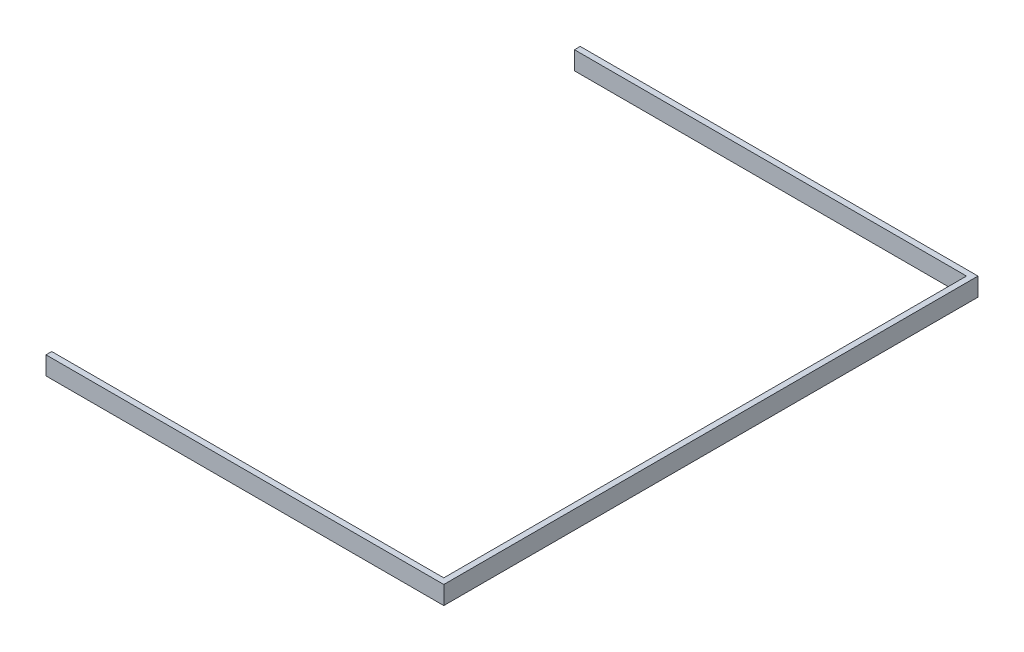
ISO-10303-21;
HEADER;
FILE_DESCRIPTION(('STEP AP214'),'2;1');
FILE_NAME('part.step','',(''),(''),'','','');
FILE_SCHEMA(('AUTOMOTIVE_DESIGN { 1 0 10303 214 1 1 1 1 }'));
ENDSEC;
DATA;
#1=APPLICATION_CONTEXT('core data for automotive mechanical design processes');
#2=APPLICATION_PROTOCOL_DEFINITION('international standard','automotive_design',2000,#1);
#3=PRODUCT_CONTEXT('',#1,'mechanical');
#4=PRODUCT('Part','Part','',(#3));
#5=PRODUCT_RELATED_PRODUCT_CATEGORY('part','',(#4));
#6=PRODUCT_DEFINITION_FORMATION('','',#4);
#7=PRODUCT_DEFINITION_CONTEXT('part definition',#1,'design');
#8=PRODUCT_DEFINITION('design','',#6,#7);
#9=PRODUCT_DEFINITION_SHAPE('','',#8);
#10=(LENGTH_UNIT() NAMED_UNIT(*) SI_UNIT(.MILLI.,.METRE.));
#11=(NAMED_UNIT(*) PLANE_ANGLE_UNIT() SI_UNIT($,.RADIAN.));
#12=(NAMED_UNIT(*) SI_UNIT($,.STERADIAN.) SOLID_ANGLE_UNIT());
#13=UNCERTAINTY_MEASURE_WITH_UNIT(LENGTH_MEASURE(1.E-05),#10,'distance_accuracy_value','');
#14=(GEOMETRIC_REPRESENTATION_CONTEXT(3) GLOBAL_UNCERTAINTY_ASSIGNED_CONTEXT((#13)) GLOBAL_UNIT_ASSIGNED_CONTEXT((#10,
#11,#12)) REPRESENTATION_CONTEXT('',''));
#15=CARTESIAN_POINT('',(0.,0.,0.));
#16=DIRECTION('',(0.,0.,1.));
#17=DIRECTION('',(1.,0.,0.));
#18=AXIS2_PLACEMENT_3D('',#15,#16,#17);
#19=CARTESIAN_POINT('',(3044.,-0.01,2044.01));
#20=DIRECTION('',(1.,0.,0.));
#21=DIRECTION('',(0.,0.,-1.));
#22=AXIS2_PLACEMENT_3D('',#19,#20,#21);
#23=PLANE('',#22);
#24=DIRECTION('',(0.,0.,-1.));
#25=VECTOR('',#24,1.);
#26=CARTESIAN_POINT('',(3044.,70.,1022.));
#27=LINE('',#26,#25);
#28=CARTESIAN_POINT('',(3044.,70.,2044.));
#29=VERTEX_POINT('',#28);
#30=CARTESIAN_POINT('',(3044.,70.,0.));
#31=VERTEX_POINT('',#30);
#32=EDGE_CURVE('E136',#29,#31,#27,.T.);
#33=ORIENTED_EDGE('',*,*,#32,.F.);
#34=DIRECTION('',(0.,1.,0.));
#35=VECTOR('',#34,1.);
#36=CARTESIAN_POINT('',(3044.,35.,2044.));
#37=LINE('',#36,#35);
#38=CARTESIAN_POINT('',(3044.,0.,2044.));
#39=VERTEX_POINT('',#38);
#40=EDGE_CURVE('E125',#39,#29,#37,.T.);
#41=ORIENTED_EDGE('',*,*,#40,.F.);
#42=DIRECTION('',(0.,0.,1.));
#43=VECTOR('',#42,1.);
#44=CARTESIAN_POINT('',(3044.,0.,1022.));
#45=LINE('',#44,#43);
#46=CARTESIAN_POINT('',(3044.,0.,0.));
#47=VERTEX_POINT('',#46);
#48=EDGE_CURVE('E124',#47,#39,#45,.T.);
#49=ORIENTED_EDGE('',*,*,#48,.F.);
#50=DIRECTION('',(0.,-1.,0.));
#51=VECTOR('',#50,1.);
#52=CARTESIAN_POINT('',(3044.,35.,0.));
#53=LINE('',#52,#51);
#54=EDGE_CURVE('E21',#31,#47,#53,.T.);
#55=ORIENTED_EDGE('',*,*,#54,.F.);
#56=EDGE_LOOP('',(#33,#41,#49,#55));
#57=FACE_BOUND('',#56,.T.);
#58=ADVANCED_FACE('F17',(#57),#23,.T.);
#59=CARTESIAN_POINT('',(3044.01,-0.01,0.));
#60=DIRECTION('',(0.,0.,-1.));
#61=DIRECTION('',(-1.,0.,0.));
#62=AXIS2_PLACEMENT_3D('',#59,#60,#61);
#63=PLANE('',#62);
#64=DIRECTION('',(-1.,0.,0.));
#65=VECTOR('',#64,1.);
#66=CARTESIAN_POINT('',(2283.,70.,-1.11459371463299E-13));
#67=LINE('',#66,#65);
#68=CARTESIAN_POINT('',(1522.,70.,0.));
#69=VERTEX_POINT('',#68);
#70=EDGE_CURVE('E119',#31,#69,#67,.T.);
#71=ORIENTED_EDGE('',*,*,#70,.F.);
#72=ORIENTED_EDGE('',*,*,#54,.T.);
#73=DIRECTION('',(1.,0.,0.));
#74=VECTOR('',#73,1.);
#75=CARTESIAN_POINT('',(2283.,0.,-1.11459371463299E-13));
#76=LINE('',#75,#74);
#77=CARTESIAN_POINT('',(1522.,0.,0.));
#78=VERTEX_POINT('',#77);
#79=EDGE_CURVE('E117',#78,#47,#76,.T.);
#80=ORIENTED_EDGE('',*,*,#79,.F.);
#81=DIRECTION('',(0.,-1.,0.));
#82=VECTOR('',#81,1.);
#83=CARTESIAN_POINT('',(1522.,35.,0.));
#84=LINE('',#83,#82);
#85=EDGE_CURVE('E108',#69,#78,#84,.T.);
#86=ORIENTED_EDGE('',*,*,#85,.F.);
#87=EDGE_LOOP('',(#71,#72,#80,#86));
#88=FACE_BOUND('',#87,.T.);
#89=ADVANCED_FACE('F115',(#88),#63,.T.);
#90=CARTESIAN_POINT('',(1522.,-0.01,-0.00999999999996337));
#91=DIRECTION('',(-1.,0.,0.));
#92=DIRECTION('',(0.,0.,1.));
#93=AXIS2_PLACEMENT_3D('',#90,#91,#92);
#94=PLANE('',#93);
#95=DIRECTION('',(0.,0.,1.));
#96=VECTOR('',#95,1.);
#97=CARTESIAN_POINT('',(1522.,70.,1022.));
#98=LINE('',#97,#96);
#99=CARTESIAN_POINT('',(1522.,70.,22.));
#100=VERTEX_POINT('',#99);
#101=EDGE_CURVE('E139',#69,#100,#98,.T.);
#102=ORIENTED_EDGE('',*,*,#101,.F.);
#103=ORIENTED_EDGE('',*,*,#85,.T.);
#104=DIRECTION('',(0.,0.,-1.));
#105=VECTOR('',#104,1.);
#106=CARTESIAN_POINT('',(1522.,0.,1022.));
#107=LINE('',#106,#105);
#108=CARTESIAN_POINT('',(1522.,0.,22.0000000000001));
#109=VERTEX_POINT('',#108);
#110=EDGE_CURVE('E99',#109,#78,#107,.T.);
#111=ORIENTED_EDGE('',*,*,#110,.F.);
#112=DIRECTION('',(0.,-1.,0.));
#113=VECTOR('',#112,1.);
#114=CARTESIAN_POINT('',(1522.,35.,22.));
#115=LINE('',#114,#113);
#116=EDGE_CURVE('E80',#100,#109,#115,.T.);
#117=ORIENTED_EDGE('',*,*,#116,.F.);
#118=EDGE_LOOP('',(#102,#103,#111,#117));
#119=FACE_BOUND('',#118,.T.);
#120=ADVANCED_FACE('F179',(#119),#94,.T.);
#121=CARTESIAN_POINT('',(1521.99,-0.01,22.));
#122=DIRECTION('',(0.,0.,1.));
#123=DIRECTION('',(1.,0.,0.));
#124=AXIS2_PLACEMENT_3D('',#121,#122,#123);
#125=PLANE('',#124);
#126=DIRECTION('',(1.,0.,0.));
#127=VECTOR('',#126,1.);
#128=CARTESIAN_POINT('',(2283.,70.,22.0000000000001));
#129=LINE('',#128,#127);
#130=CARTESIAN_POINT('',(3022.,70.,22.));
#131=VERTEX_POINT('',#130);
#132=EDGE_CURVE('E142',#100,#131,#129,.T.);
#133=ORIENTED_EDGE('',*,*,#132,.F.);
#134=ORIENTED_EDGE('',*,*,#116,.T.);
#135=DIRECTION('',(-1.,0.,0.));
#136=VECTOR('',#135,1.);
#137=CARTESIAN_POINT('',(2283.,0.,22.0000000000001));
#138=LINE('',#137,#136);
#139=CARTESIAN_POINT('',(3022.,0.,22.));
#140=VERTEX_POINT('',#139);
#141=EDGE_CURVE('E95',#140,#109,#138,.T.);
#142=ORIENTED_EDGE('',*,*,#141,.F.);
#143=DIRECTION('',(0.,-1.,0.));
#144=VECTOR('',#143,1.);
#145=CARTESIAN_POINT('',(3022.,35.,21.9999999999999));
#146=LINE('',#145,#144);
#147=EDGE_CURVE('E85',#131,#140,#146,.T.);
#148=ORIENTED_EDGE('',*,*,#147,.F.);
#149=EDGE_LOOP('',(#133,#134,#142,#148));
#150=FACE_BOUND('',#149,.T.);
#151=ADVANCED_FACE('F96',(#150),#125,.T.);
#152=CARTESIAN_POINT('',(3022.,-0.01,21.9899999999998));
#153=DIRECTION('',(-1.,0.,0.));
#154=DIRECTION('',(0.,0.,1.));
#155=AXIS2_PLACEMENT_3D('',#152,#153,#154);
#156=PLANE('',#155);
#157=DIRECTION('',(0.,0.,1.));
#158=VECTOR('',#157,1.);
#159=CARTESIAN_POINT('',(3022.,70.,1022.));
#160=LINE('',#159,#158);
#161=CARTESIAN_POINT('',(3022.,70.,2022.));
#162=VERTEX_POINT('',#161);
#163=EDGE_CURVE('E91',#131,#162,#160,.T.);
#164=ORIENTED_EDGE('',*,*,#163,.F.);
#165=ORIENTED_EDGE('',*,*,#147,.T.);
#166=DIRECTION('',(0.,0.,-1.));
#167=VECTOR('',#166,1.);
#168=CARTESIAN_POINT('',(3022.,0.,1022.));
#169=LINE('',#168,#167);
#170=CARTESIAN_POINT('',(3022.,0.,2022.));
#171=VERTEX_POINT('',#170);
#172=EDGE_CURVE('E89',#171,#140,#169,.T.);
#173=ORIENTED_EDGE('',*,*,#172,.F.);
#174=DIRECTION('',(0.,-1.,0.));
#175=VECTOR('',#174,1.);
#176=CARTESIAN_POINT('',(3022.,35.,2022.));
#177=LINE('',#176,#175);
#178=EDGE_CURVE('E147',#162,#171,#177,.T.);
#179=ORIENTED_EDGE('',*,*,#178,.F.);
#180=EDGE_LOOP('',(#164,#165,#173,#179));
#181=FACE_BOUND('',#180,.T.);
#182=ADVANCED_FACE('F86',(#181),#156,.T.);
#183=CARTESIAN_POINT('',(3044.01,0.,2044.01));
#184=DIRECTION('',(0.,-1.,0.));
#185=DIRECTION('',(-1.,0.,0.));
#186=AXIS2_PLACEMENT_3D('',#183,#184,#185);
#187=PLANE('',#186);
#188=DIRECTION('',(1.,0.,0.));
#189=VECTOR('',#188,1.);
#190=CARTESIAN_POINT('',(2283.,0.,2044.));
#191=LINE('',#190,#189);
#192=CARTESIAN_POINT('',(1522.,0.,2044.));
#193=VERTEX_POINT('',#192);
#194=EDGE_CURVE('E127',#193,#39,#191,.T.);
#195=ORIENTED_EDGE('',*,*,#194,.F.);
#196=DIRECTION('',(0.,0.,1.));
#197=VECTOR('',#196,1.);
#198=CARTESIAN_POINT('',(1522.,0.,2033.));
#199=LINE('',#198,#197);
#200=CARTESIAN_POINT('',(1522.,0.,2022.));
#201=VERTEX_POINT('',#200);
#202=EDGE_CURVE('E149',#201,#193,#199,.T.);
#203=ORIENTED_EDGE('',*,*,#202,.F.);
#204=DIRECTION('',(-1.,0.,0.));
#205=VECTOR('',#204,1.);
#206=CARTESIAN_POINT('',(2272.,0.,2022.));
#207=LINE('',#206,#205);
#208=EDGE_CURVE('E103',#171,#201,#207,.T.);
#209=ORIENTED_EDGE('',*,*,#208,.F.);
#210=ORIENTED_EDGE('',*,*,#172,.T.);
#211=ORIENTED_EDGE('',*,*,#141,.T.);
#212=ORIENTED_EDGE('',*,*,#110,.T.);
#213=ORIENTED_EDGE('',*,*,#79,.T.);
#214=ORIENTED_EDGE('',*,*,#48,.T.);
#215=EDGE_LOOP('',(#195,#203,#209,#210,#211,#212,#213,#214));
#216=FACE_BOUND('',#215,.T.);
#217=ADVANCED_FACE('F101',(#216),#187,.T.);
#218=CARTESIAN_POINT('',(1521.99,-0.01,2044.));
#219=DIRECTION('',(0.,0.,1.));
#220=DIRECTION('',(1.,0.,0.));
#221=AXIS2_PLACEMENT_3D('',#218,#219,#220);
#222=PLANE('',#221);
#223=DIRECTION('',(1.,0.,0.));
#224=VECTOR('',#223,1.);
#225=CARTESIAN_POINT('',(2283.,70.,2044.));
#226=LINE('',#225,#224);
#227=CARTESIAN_POINT('',(1522.,70.,2044.));
#228=VERTEX_POINT('',#227);
#229=EDGE_CURVE('E133',#228,#29,#226,.T.);
#230=ORIENTED_EDGE('',*,*,#229,.F.);
#231=DIRECTION('',(0.,1.,0.));
#232=VECTOR('',#231,1.);
#233=CARTESIAN_POINT('',(1522.,35.,2044.));
#234=LINE('',#233,#232);
#235=EDGE_CURVE('E152',#193,#228,#234,.T.);
#236=ORIENTED_EDGE('',*,*,#235,.F.);
#237=ORIENTED_EDGE('',*,*,#194,.T.);
#238=ORIENTED_EDGE('',*,*,#40,.T.);
#239=EDGE_LOOP('',(#230,#236,#237,#238));
#240=FACE_BOUND('',#239,.T.);
#241=ADVANCED_FACE('F160',(#240),#222,.T.);
#242=CARTESIAN_POINT('',(3044.01,70.,2044.01));
#243=DIRECTION('',(0.,1.,0.));
#244=DIRECTION('',(0.,0.,-1.));
#245=AXIS2_PLACEMENT_3D('',#242,#243,#244);
#246=PLANE('',#245);
#247=ORIENTED_EDGE('',*,*,#132,.T.);
#248=ORIENTED_EDGE('',*,*,#163,.T.);
#249=DIRECTION('',(1.,0.,0.));
#250=VECTOR('',#249,1.);
#251=CARTESIAN_POINT('',(2272.,70.,2022.));
#252=LINE('',#251,#250);
#253=CARTESIAN_POINT('',(1522.,70.,2022.));
#254=VERTEX_POINT('',#253);
#255=EDGE_CURVE('E36',#254,#162,#252,.T.);
#256=ORIENTED_EDGE('',*,*,#255,.F.);
#257=DIRECTION('',(0.,0.,-1.));
#258=VECTOR('',#257,1.);
#259=CARTESIAN_POINT('',(1522.,70.,2033.));
#260=LINE('',#259,#258);
#261=EDGE_CURVE('E27',#228,#254,#260,.T.);
#262=ORIENTED_EDGE('',*,*,#261,.F.);
#263=ORIENTED_EDGE('',*,*,#229,.T.);
#264=ORIENTED_EDGE('',*,*,#32,.T.);
#265=ORIENTED_EDGE('',*,*,#70,.T.);
#266=ORIENTED_EDGE('',*,*,#101,.T.);
#267=EDGE_LOOP('',(#247,#248,#256,#262,#263,#264,#265,#266));
#268=FACE_BOUND('',#267,.T.);
#269=ADVANCED_FACE('F158',(#268),#246,.T.);
#270=CARTESIAN_POINT('',(3022.01,-0.01,2022.));
#271=DIRECTION('',(0.,0.,-1.));
#272=DIRECTION('',(-1.,0.,0.));
#273=AXIS2_PLACEMENT_3D('',#270,#271,#272);
#274=PLANE('',#273);
#275=ORIENTED_EDGE('',*,*,#255,.T.);
#276=ORIENTED_EDGE('',*,*,#178,.T.);
#277=ORIENTED_EDGE('',*,*,#208,.T.);
#278=DIRECTION('',(0.,-1.,0.));
#279=VECTOR('',#278,1.);
#280=CARTESIAN_POINT('',(1522.,35.,2022.));
#281=LINE('',#280,#279);
#282=EDGE_CURVE('E11',#254,#201,#281,.T.);
#283=ORIENTED_EDGE('',*,*,#282,.F.);
#284=EDGE_LOOP('',(#275,#276,#277,#283));
#285=FACE_BOUND('',#284,.T.);
#286=ADVANCED_FACE('F162',(#285),#274,.T.);
#287=CARTESIAN_POINT('',(1522.,-0.01,2021.99));
#288=DIRECTION('',(-1.,0.,0.));
#289=DIRECTION('',(0.,0.,1.));
#290=AXIS2_PLACEMENT_3D('',#287,#288,#289);
#291=PLANE('',#290);
#292=ORIENTED_EDGE('',*,*,#261,.T.);
#293=ORIENTED_EDGE('',*,*,#282,.T.);
#294=ORIENTED_EDGE('',*,*,#202,.T.);
#295=ORIENTED_EDGE('',*,*,#235,.T.);
#296=EDGE_LOOP('',(#292,#293,#294,#295));
#297=FACE_BOUND('',#296,.T.);
#298=ADVANCED_FACE('F19',(#297),#291,.T.);
#299=CLOSED_SHELL('',(#58,#89,#120,#151,#182,#217,#241,#269,#286,#298));
#300=MANIFOLD_SOLID_BREP('B1',#299);
#301=ADVANCED_BREP_SHAPE_REPRESENTATION('',(#18,#300),#14);
#302=SHAPE_DEFINITION_REPRESENTATION(#9,#301);
ENDSEC;
END-ISO-10303-21;
